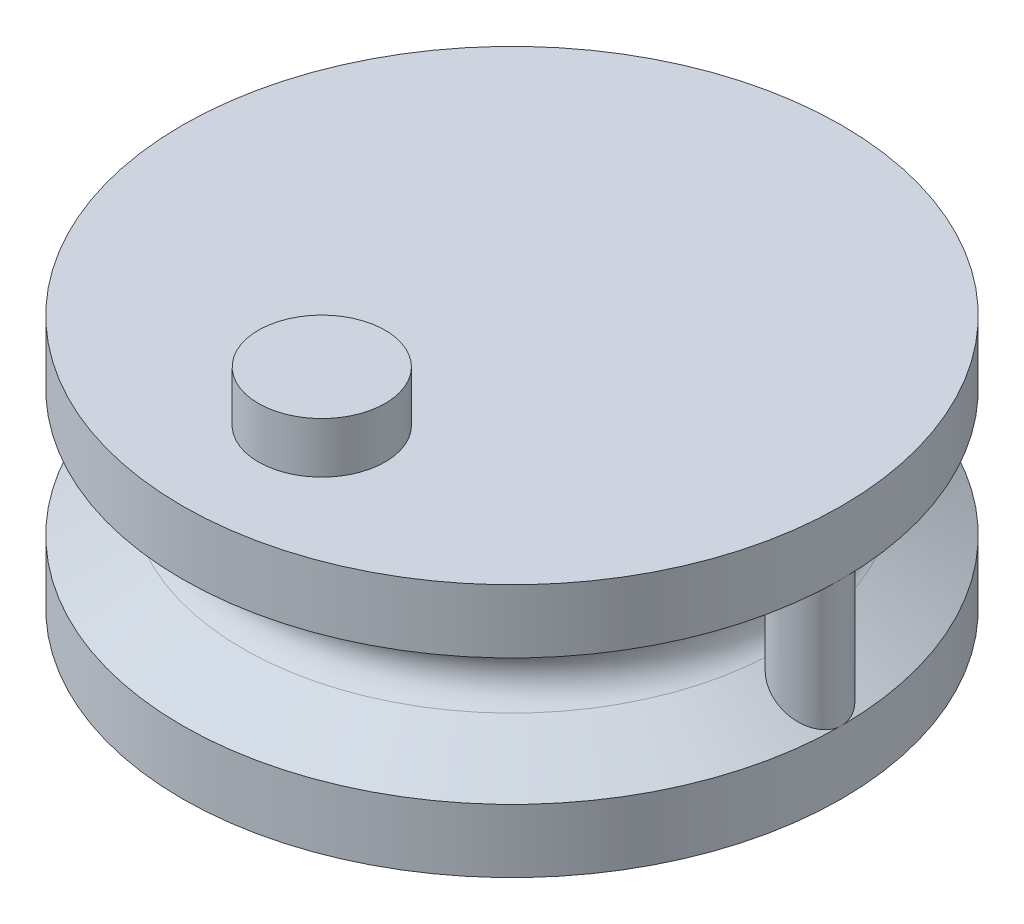
ISO-10303-21;
HEADER;
FILE_DESCRIPTION(('STEP AP214'),'2;1');
FILE_NAME('part.step','',(''),(''),'','','');
FILE_SCHEMA(('AUTOMOTIVE_DESIGN { 1 0 10303 214 1 1 1 1 }'));
ENDSEC;
DATA;
#1=APPLICATION_CONTEXT('core data for automotive mechanical design processes');
#2=APPLICATION_PROTOCOL_DEFINITION('international standard','automotive_design',2000,#1);
#3=PRODUCT_CONTEXT('',#1,'mechanical');
#4=PRODUCT('Part','Part','',(#3));
#5=PRODUCT_RELATED_PRODUCT_CATEGORY('part','',(#4));
#6=PRODUCT_DEFINITION_FORMATION('','',#4);
#7=PRODUCT_DEFINITION_CONTEXT('part definition',#1,'design');
#8=PRODUCT_DEFINITION('design','',#6,#7);
#9=PRODUCT_DEFINITION_SHAPE('','',#8);
#10=(LENGTH_UNIT() NAMED_UNIT(*) SI_UNIT(.MILLI.,.METRE.));
#11=(NAMED_UNIT(*) PLANE_ANGLE_UNIT() SI_UNIT($,.RADIAN.));
#12=(NAMED_UNIT(*) SI_UNIT($,.STERADIAN.) SOLID_ANGLE_UNIT());
#13=UNCERTAINTY_MEASURE_WITH_UNIT(LENGTH_MEASURE(1.E-05),#10,'distance_accuracy_value','');
#14=(GEOMETRIC_REPRESENTATION_CONTEXT(3) GLOBAL_UNCERTAINTY_ASSIGNED_CONTEXT((#13)) GLOBAL_UNIT_ASSIGNED_CONTEXT((#10,
#11,#12)) REPRESENTATION_CONTEXT('',''));
#15=CARTESIAN_POINT('',(0.,0.,0.));
#16=DIRECTION('',(0.,0.,1.));
#17=DIRECTION('',(1.,0.,0.));
#18=AXIS2_PLACEMENT_3D('',#15,#16,#17);
#19=CARTESIAN_POINT('',(0.,0.,0.));
#20=DIRECTION('',(0.,1.,0.));
#21=DIRECTION('',(0.,0.,1.));
#22=AXIS2_PLACEMENT_3D('',#19,#20,#21);
#23=PLANE('',#22);
#24=CARTESIAN_POINT('',(0.,0.,0.));
#25=DIRECTION('',(0.,-1.,0.));
#26=DIRECTION('',(0.,0.,-1.));
#27=AXIS2_PLACEMENT_3D('',#24,#25,#26);
#28=CIRCLE('',#27,5.);
#29=CARTESIAN_POINT('',(0.,0.,-5.));
#30=VERTEX_POINT('',#29);
#31=EDGE_CURVE('E131',#30,#30,#28,.T.);
#32=ORIENTED_EDGE('',*,*,#31,.F.);
#33=EDGE_LOOP('',(#32));
#34=FACE_BOUND('',#33,.T.);
#35=CARTESIAN_POINT('',(0.,0.,0.));
#36=DIRECTION('',(0.,1.,0.));
#37=DIRECTION('',(0.,0.,1.));
#38=AXIS2_PLACEMENT_3D('',#35,#36,#37);
#39=CIRCLE('',#38,13.);
#40=CARTESIAN_POINT('',(0.,0.,13.));
#41=VERTEX_POINT('',#40);
#42=EDGE_CURVE('E11',#41,#41,#39,.T.);
#43=ORIENTED_EDGE('',*,*,#42,.F.);
#44=EDGE_LOOP('',(#43));
#45=FACE_BOUND('',#44,.T.);
#46=ADVANCED_FACE('F41',(#34,#45),#23,.F.);
#47=CARTESIAN_POINT('',(0.,5.,0.));
#48=DIRECTION('',(0.,1.,0.));
#49=DIRECTION('',(0.,0.,1.));
#50=AXIS2_PLACEMENT_3D('',#47,#48,#49);
#51=TOROIDAL_SURFACE('',#50,11.25,1.25);
#52=CARTESIAN_POINT('',(0.,6.07339514328541,0.));
#53=DIRECTION('',(0.,1.,0.));
#54=DIRECTION('',(0.,0.,1.));
#55=AXIS2_PLACEMENT_3D('',#52,#53,#54);
#56=CIRCLE('',#55,10.6094355095923);
#57=CARTESIAN_POINT('',(10.5983030566893,6.07339514328541,-0.485895205541975));
#58=VERTEX_POINT('',#57);
#59=CARTESIAN_POINT('',(10.5983030566892,6.07339514328542,0.485895205541961));
#60=VERTEX_POINT('',#59);
#61=EDGE_CURVE('E86',#58,#60,#56,.T.);
#62=ORIENTED_EDGE('',*,*,#61,.F.);
#63=CARTESIAN_POINT('',(10.5986057774209,6.07359514328844,-0.486612108574577));
#64=CARTESIAN_POINT('',(10.5874376178115,6.06621935586201,-0.460178732302496));
#65=CARTESIAN_POINT('',(10.5771491108793,6.0591221887238,-0.433301970550186));
#66=CARTESIAN_POINT('',(10.5583894184902,6.04576507708734,-0.378684459262579));
#67=CARTESIAN_POINT('',(10.549920338947,6.03950610588804,-0.350942750645623));
#68=CARTESIAN_POINT('',(10.5274174165239,6.022472022018,-0.266743019705615));
#69=CARTESIAN_POINT('',(10.516209247812,6.01338442465254,-0.209125686818043));
#70=CARTESIAN_POINT('',(10.5019598698965,6.00169720924882,-0.0917324433844314));
#71=CARTESIAN_POINT('',(10.4989850841388,5.99915037107196,-0.0319428969526997));
#72=CARTESIAN_POINT('',(10.5016281301411,6.00136409866122,0.0873116197066418));
#73=CARTESIAN_POINT('',(10.5072456908742,6.00612443393841,0.146776600112608));
#74=CARTESIAN_POINT('',(10.5250720913205,6.02047465521608,0.254011373223486));
#75=CARTESIAN_POINT('',(10.5360725095186,6.02916236931784,0.302121266512563));
#76=CARTESIAN_POINT('',(10.5634235033484,6.04949345656177,0.396148457553712));
#77=CARTESIAN_POINT('',(10.5797726702633,6.06113605128694,0.44206632898048));
#78=CARTESIAN_POINT('',(10.5986057774209,6.07359514328844,0.486612108574578));
#79=B_SPLINE_CURVE_WITH_KNOTS('',3,(#63,#64,#65,#66,#67,#68,#69,#70,#71,#72,#73,#74,#75,#76,#77,
#78),.UNSPECIFIED.,.F.,.F.,(4,2,2,2,2,2,2,4),(0.,0.088851869004259,0.177806032882704,
0.355096081658541,0.533812319309718,0.712522919860718,0.862426806079175,1.01229124338235),.UNSPECIFIED.);
#80=EDGE_CURVE('E64',#58,#60,#79,.T.);
#81=ORIENTED_EDGE('',*,*,#80,.T.);
#82=EDGE_LOOP('',(#62,#81));
#83=FACE_BOUND('',#82,.T.);
#84=CARTESIAN_POINT('',(0.,3.92660485671459,0.));
#85=DIRECTION('',(0.,1.,0.));
#86=DIRECTION('',(0.,0.,1.));
#87=AXIS2_PLACEMENT_3D('',#84,#85,#86);
#88=CIRCLE('',#87,10.6094355095923);
#89=CARTESIAN_POINT('',(10.5983030566892,3.9266048567146,-0.485895205541963));
#90=VERTEX_POINT('',#89);
#91=CARTESIAN_POINT('',(10.5983030566893,3.92660485671459,0.485895205541971));
#92=VERTEX_POINT('',#91);
#93=EDGE_CURVE('E96',#90,#92,#88,.T.);
#94=ORIENTED_EDGE('',*,*,#93,.T.);
#95=CARTESIAN_POINT('',(10.5986057774209,3.92640485671157,0.486612108574577));
#96=CARTESIAN_POINT('',(10.5874376178115,3.93378064413799,0.460178732302496));
#97=CARTESIAN_POINT('',(10.5771491108793,3.9408778112762,0.433301970550186));
#98=CARTESIAN_POINT('',(10.5583894184902,3.95423492291266,0.378684459262579));
#99=CARTESIAN_POINT('',(10.549920338947,3.96049389411196,0.350942750645623));
#100=CARTESIAN_POINT('',(10.5274174165239,3.977527977982,0.266743019705615));
#101=CARTESIAN_POINT('',(10.516209247812,3.98661557534746,0.209125686818043));
#102=CARTESIAN_POINT('',(10.5019598698965,3.99830279075118,0.0917324433844314));
#103=CARTESIAN_POINT('',(10.4989850841388,4.00084962892804,0.0319428969526997));
#104=CARTESIAN_POINT('',(10.5016281301411,3.99863590133878,-0.0873116197066418));
#105=CARTESIAN_POINT('',(10.5072456908742,3.99387556606159,-0.146776600112608));
#106=CARTESIAN_POINT('',(10.5250720913205,3.97952534478392,-0.254011373223486));
#107=CARTESIAN_POINT('',(10.5360725095186,3.97083763068216,-0.302121266512563));
#108=CARTESIAN_POINT('',(10.5634235033484,3.95050654343823,-0.396148457553712));
#109=CARTESIAN_POINT('',(10.5797726702633,3.93886394871306,-0.44206632898048));
#110=CARTESIAN_POINT('',(10.5986057774209,3.92640485671157,-0.486612108574578));
#111=B_SPLINE_CURVE_WITH_KNOTS('',3,(#95,#96,#97,#98,#99,#100,#101,#102,#103,#104,#105,#106,
#107,#108,#109,#110),.UNSPECIFIED.,.F.,.F.,(4,2,2,2,2,2,2,4),(0.,0.0888518690042589,
0.177806032882704,0.355096081658541,0.533812319309718,0.712522919860718,0.862426806079175,
1.01229124338235),.UNSPECIFIED.);
#112=EDGE_CURVE('E56',#92,#90,#111,.T.);
#113=ORIENTED_EDGE('',*,*,#112,.T.);
#114=EDGE_LOOP('',(#94,#113));
#115=FACE_BOUND('',#114,.T.);
#116=ADVANCED_FACE('F117',(#83,#115),#51,.F.);
#117=CARTESIAN_POINT('',(0.,10.,0.));
#118=DIRECTION('',(0.,1.,0.));
#119=DIRECTION('',(0.,0.,1.));
#120=AXIS2_PLACEMENT_3D('',#117,#118,#119);
#121=CYLINDRICAL_SURFACE('',#120,13.);
#122=CARTESIAN_POINT('',(0.,2.5,0.));
#123=DIRECTION('',(0.,1.,0.));
#124=DIRECTION('',(0.,0.,1.));
#125=AXIS2_PLACEMENT_3D('',#122,#123,#124);
#126=CIRCLE('',#125,13.);
#127=CARTESIAN_POINT('',(13.0000000000077,2.49999999999583,9.74554015543786E-13));
#128=VERTEX_POINT('',#127);
#129=EDGE_CURVE('E49',#128,#128,#126,.T.);
#130=ORIENTED_EDGE('',*,*,#129,.F.);
#131=EDGE_LOOP('',(#130));
#132=FACE_BOUND('',#131,.T.);
#133=ORIENTED_EDGE('',*,*,#42,.T.);
#134=EDGE_LOOP('',(#133));
#135=FACE_BOUND('',#134,.T.);
#136=ADVANCED_FACE('F114',(#132,#135),#121,.T.);
#137=CARTESIAN_POINT('',(0.,2.5,0.));
#138=DIRECTION('',(0.,-1.,0.));
#139=DIRECTION('',(0.,0.,-1.));
#140=AXIS2_PLACEMENT_3D('',#137,#138,#139);
#141=CONICAL_SURFACE('',#140,13.,1.03275900968104);
#142=ORIENTED_EDGE('',*,*,#93,.F.);
#143=CARTESIAN_POINT('',(10.5980004529343,3.92680485671459,-0.485177332076041));
#144=CARTESIAN_POINT('',(10.6257304926425,3.9084733897933,-0.551106822045929));
#145=CARTESIAN_POINT('',(10.6587348866453,3.88674129855949,-0.613594707935515));
#146=CARTESIAN_POINT('',(10.7332607631536,3.83798342743085,-0.730398670546439));
#147=CARTESIAN_POINT('',(10.7747284238184,3.81099114623759,-0.784762800893945));
#148=CARTESIAN_POINT('',(10.8643677585419,3.75306940458037,-0.884679302956029));
#149=CARTESIAN_POINT('',(10.9125137196765,3.72215508206009,-0.93026394197197));
#150=CARTESIAN_POINT('',(11.0141982953878,3.65737279589803,-1.01261148485055));
#151=CARTESIAN_POINT('',(11.0677462507153,3.62349973025208,-1.04935872328968));
#152=CARTESIAN_POINT('',(11.1862532679122,3.54914553481268,-1.11802576839876));
#153=CARTESIAN_POINT('',(11.2517833777605,3.50838422029922,-1.14865650779568));
#154=CARTESIAN_POINT('',(11.3863187969773,3.4254852120731,-1.19807145689664));
#155=CARTESIAN_POINT('',(11.4553248102176,3.38334724019885,-1.21685325668757));
#156=CARTESIAN_POINT('',(11.6034810887433,3.29371840220463,-1.24392225170286));
#157=CARTESIAN_POINT('',(11.6828752262021,3.24617685859394,-1.25072849837575));
#158=CARTESIAN_POINT('',(11.8420064702492,3.15184401720393,-1.24914767924862));
#159=CARTESIAN_POINT('',(11.9217437127305,3.10505305977363,-1.24075390717977));
#160=CARTESIAN_POINT('',(12.081113255177,3.01241355316657,-1.20815161856453));
#161=CARTESIAN_POINT('',(12.1606999952097,2.96661222236718,-1.18357987757434));
#162=CARTESIAN_POINT('',(12.315051393125,2.87856144215623,-1.11813887874308));
#163=CARTESIAN_POINT('',(12.3898175280562,2.83631090355508,-1.07727464080818));
#164=CARTESIAN_POINT('',(12.5259098787551,2.75998594778746,-0.983249061825821));
#165=CARTESIAN_POINT('',(12.5878249851173,2.72553476879276,-0.931252220234313));
#166=CARTESIAN_POINT('',(12.7017665016568,2.66250010017289,-0.814417380432933));
#167=CARTESIAN_POINT('',(12.7538039797609,2.63391004022765,-0.749593922916129));
#168=CARTESIAN_POINT('',(12.8387389971617,2.58744422135057,-0.618393401891886));
#169=CARTESIAN_POINT('',(12.8732706391943,2.56864391277726,-0.553402238571116));
#170=CARTESIAN_POINT('',(12.9306875777581,2.53746060773138,-0.417049495368043));
#171=CARTESIAN_POINT('',(12.9535848546738,2.52507100964437,-0.345694557923593));
#172=CARTESIAN_POINT('',(12.9842592152873,2.50849113620469,-0.208382970445588));
#173=CARTESIAN_POINT('',(12.9935675198905,2.50347009405495,-0.142865088495687));
#174=CARTESIAN_POINT('',(13.0016929181009,2.49908655868955,-0.0110028808536322));
#175=CARTESIAN_POINT('',(13.0005145311779,2.49972162784864,0.0553410765137992));
#176=CARTESIAN_POINT('',(12.9881222034786,2.50640873608915,0.182780887578219));
#177=CARTESIAN_POINT('',(12.9775101049081,2.51213591760402,0.243953984699323));
#178=CARTESIAN_POINT('',(12.947576046895,2.52832413743864,0.363464451283731));
#179=CARTESIAN_POINT('',(12.9282540177263,2.53878521365498,0.421801798041658));
#180=CARTESIAN_POINT('',(12.881279952681,2.5642914252614,0.535305442755208));
#181=CARTESIAN_POINT('',(12.8534741692602,2.57942123317759,0.590388683738321));
#182=CARTESIAN_POINT('',(12.7907765928815,2.61366550578693,0.694986230819947));
#183=CARTESIAN_POINT('',(12.7558828313708,2.6327810774902,0.744498983871074));
#184=CARTESIAN_POINT('',(12.6770708925453,2.67614980563988,0.840970703082159));
#185=CARTESIAN_POINT('',(12.6326457940498,2.70069664829767,0.88738230540038));
#186=CARTESIAN_POINT('',(12.5383679895887,2.75308050935926,0.972110351000492));
#187=CARTESIAN_POINT('',(12.4885129585613,2.78091893763882,1.01042330568108));
#188=CARTESIAN_POINT('',(12.3785544506262,2.84269822686554,1.08270383360064));
#189=CARTESIAN_POINT('',(12.3179380063715,2.87697086143869,1.1156068066617));
#190=CARTESIAN_POINT('',(12.1933627131127,2.94793742506515,1.17071575598987));
#191=CARTESIAN_POINT('',(12.1294022117072,2.98463255354499,1.19291638745608));
#192=CARTESIAN_POINT('',(11.9916542863301,3.06429358829496,1.22872696823175));
#193=CARTESIAN_POINT('',(11.9176272685544,3.10747495837174,1.24094092701255));
#194=CARTESIAN_POINT('',(11.7691876363497,3.19487670100951,1.2520693408178));
#195=CARTESIAN_POINT('',(11.6947748804794,3.23909747933072,1.25097851292803));
#196=CARTESIAN_POINT('',(11.541017638136,3.3313467532491,1.23502914421577));
#197=CARTESIAN_POINT('',(11.4617932514236,3.37937860917254,1.21900530573863));
#198=CARTESIAN_POINT('',(11.3070822042854,3.47414811305626,1.17169687300017));
#199=CARTESIAN_POINT('',(11.2315992415631,3.5208844613092,1.14039750040606));
#200=CARTESIAN_POINT('',(11.0866472011982,3.61152592737892,1.06265914336575));
#201=CARTESIAN_POINT('',(11.0171919171389,3.65542449566626,1.01618653610862));
#202=CARTESIAN_POINT('',(10.8874390019171,3.73817852129857,0.90859856542604));
#203=CARTESIAN_POINT('',(10.8271106734487,3.7770508166906,0.847534152129413));
#204=CARTESIAN_POINT('',(10.7380759819746,3.83485004299195,0.735959659304307));
#205=CARTESIAN_POINT('',(10.7057579418319,3.85595102385282,0.689431213722903));
#206=CARTESIAN_POINT('',(10.647097174176,3.8944083073285,0.591103421093574));
#207=CARTESIAN_POINT('',(10.6207759245537,3.91175113938535,0.539286061631873));
#208=CARTESIAN_POINT('',(10.5980004529343,3.92680485671459,0.485177332076038));
#209=B_SPLINE_CURVE_WITH_KNOTS('',3,(#143,#144,#145,#146,#147,#148,#149,#150,#151,#152,#153,
#154,#155,#156,#157,#158,#159,#160,#161,#162,#163,#164,#165,#166,#167,#168,#169,#170,#171,#172,
#173,#174,#175,#176,#177,#178,#179,#180,#181,#182,#183,#184,#185,#186,#187,#188,#189,#190,#191,
#192,#193,#194,#195,#196,#197,#198,#199,#200,#201,#202,#203,#204,#205,#206,#207,#208),
.UNSPECIFIED.,.F.,.F.,(4,2,2,2,2,2,2,2,2,2,2,2,2,2,2,2,2,2,2,2,2,2,2,2,2,2,2,2,2,2,2,2,4),(0.,
0.220811507181103,0.440260237125652,0.658886355457387,0.877897206265925,1.12599143564779,
1.37413610776714,1.6512466168733,1.92847941730053,2.21215912039641,2.49575148596747,
2.75788455341726,3.01972214295246,3.24628378237364,3.47261164672745,3.67067341138346,
3.86864982110904,4.05483583727758,4.2410233439608,4.43080858256461,4.62064660269639,
4.82614059808111,5.03172293318531,5.26184507029394,5.4920820127546,5.75069482133525,
6.00941032030706,6.29017232050364,6.57120648427304,6.85286767507853,7.13355940342229,
7.31432558167139,7.49572934949802),.UNSPECIFIED.);
#210=EDGE_CURVE('E112',#90,#128,#209,.T.);
#211=ORIENTED_EDGE('',*,*,#210,.T.);
#212=ORIENTED_EDGE('',*,*,#129,.T.);
#213=EDGE_CURVE('E88',#128,#92,#209,.T.);
#214=ORIENTED_EDGE('',*,*,#213,.T.);
#215=EDGE_LOOP('',(#142,#211,#212,#214));
#216=FACE_BOUND('',#215,.T.);
#217=ADVANCED_FACE('F111',(#216),#141,.T.);
#218=CARTESIAN_POINT('',(0.,6.07339514328541,0.));
#219=DIRECTION('',(0.,1.,0.));
#220=DIRECTION('',(0.,0.,1.));
#221=AXIS2_PLACEMENT_3D('',#218,#219,#220);
#222=CONICAL_SURFACE('',#221,10.6094355095923,1.03275900968104);
#223=ORIENTED_EDGE('',*,*,#61,.T.);
#224=CARTESIAN_POINT('',(10.5980004529343,6.07319514328541,0.485177332076042));
#225=CARTESIAN_POINT('',(10.6257304926425,6.09152661020669,0.551106822045931));
#226=CARTESIAN_POINT('',(10.6587348866453,6.11325870144051,0.613594707935516));
#227=CARTESIAN_POINT('',(10.7332607631536,6.16201657256915,0.73039867054644));
#228=CARTESIAN_POINT('',(10.7747284238184,6.18900885376241,0.784762800893946));
#229=CARTESIAN_POINT('',(10.8643677585419,6.24693059541963,0.88467930295603));
#230=CARTESIAN_POINT('',(10.9125137196765,6.27784491793991,0.930263941971972));
#231=CARTESIAN_POINT('',(11.0141982953878,6.34262720410197,1.01261148485055));
#232=CARTESIAN_POINT('',(11.0677462507153,6.37650026974792,1.04935872328968));
#233=CARTESIAN_POINT('',(11.1862532679122,6.45085446518732,1.11802576839876));
#234=CARTESIAN_POINT('',(11.2517833777605,6.49161577970079,1.14865650779568));
#235=CARTESIAN_POINT('',(11.3863187969773,6.57451478792691,1.19807145689664));
#236=CARTESIAN_POINT('',(11.4553248102176,6.61665275980115,1.21685325668757));
#237=CARTESIAN_POINT('',(11.6034810887433,6.70628159779537,1.24392225170286));
#238=CARTESIAN_POINT('',(11.6828752262021,6.75382314140606,1.25072849837575));
#239=CARTESIAN_POINT('',(11.8420064702492,6.84815598279607,1.24914767924862));
#240=CARTESIAN_POINT('',(11.9217437127305,6.89494694022637,1.24075390717977));
#241=CARTESIAN_POINT('',(12.081113255177,6.98758644683343,1.20815161856453));
#242=CARTESIAN_POINT('',(12.1606999952097,7.03338777763282,1.18357987757434));
#243=CARTESIAN_POINT('',(12.315051393125,7.12143855784377,1.11813887874308));
#244=CARTESIAN_POINT('',(12.3898175280563,7.16368909644492,1.07727464080818));
#245=CARTESIAN_POINT('',(12.5259098787551,7.24001405221254,0.98324906182582));
#246=CARTESIAN_POINT('',(12.5878249851173,7.27446523120724,0.931252220234311));
#247=CARTESIAN_POINT('',(12.7017665016568,7.33749989982711,0.814417380432931));
#248=CARTESIAN_POINT('',(12.7538039797609,7.36608995977235,0.749593922916127));
#249=CARTESIAN_POINT('',(12.8387389971617,7.41255577864943,0.618393401891884));
#250=CARTESIAN_POINT('',(12.8732706391943,7.43135608722274,0.553402238571113));
#251=CARTESIAN_POINT('',(12.9306875777581,7.46253939226862,0.41704949536804));
#252=CARTESIAN_POINT('',(12.9535848546738,7.47492899035563,0.34569455792359));
#253=CARTESIAN_POINT('',(12.9842592152873,7.49150886379531,0.208382970445584));
#254=CARTESIAN_POINT('',(12.9935675198905,7.49652990594505,0.142865088495684));
#255=CARTESIAN_POINT('',(13.0016929181009,7.50091344131045,0.011002880853629));
#256=CARTESIAN_POINT('',(13.0005145311779,7.50027837215136,-0.0553410765138022));
#257=CARTESIAN_POINT('',(12.9881222034786,7.49359126391085,-0.182780887578222));
#258=CARTESIAN_POINT('',(12.9775101049081,7.48786408239598,-0.243953984699326));
#259=CARTESIAN_POINT('',(12.947576046895,7.47167586256136,-0.363464451283734));
#260=CARTESIAN_POINT('',(12.9282540177263,7.46121478634502,-0.421801798041661));
#261=CARTESIAN_POINT('',(12.881279952681,7.4357085747386,-0.535305442755211));
#262=CARTESIAN_POINT('',(12.8534741692602,7.42057876682241,-0.590388683738325));
#263=CARTESIAN_POINT('',(12.7907765928815,7.38633449421307,-0.69498623081995));
#264=CARTESIAN_POINT('',(12.7558828313708,7.3672189225098,-0.744498983871077));
#265=CARTESIAN_POINT('',(12.6770708925453,7.32385019436012,-0.840970703082161));
#266=CARTESIAN_POINT('',(12.6326457940498,7.29930335170233,-0.887382305400382));
#267=CARTESIAN_POINT('',(12.5383679895887,7.24691949064074,-0.972110351000494));
#268=CARTESIAN_POINT('',(12.4885129585613,7.21908106236118,-1.01042330568108));
#269=CARTESIAN_POINT('',(12.3785544506262,7.15730177313445,-1.08270383360064));
#270=CARTESIAN_POINT('',(12.3179380063715,7.12302913856131,-1.11560680666171));
#271=CARTESIAN_POINT('',(12.1933627131127,7.05206257493485,-1.17071575598987));
#272=CARTESIAN_POINT('',(12.1294022117072,7.01536744645501,-1.19291638745608));
#273=CARTESIAN_POINT('',(11.9916542863301,6.93570641170504,-1.22872696823175));
#274=CARTESIAN_POINT('',(11.9176272685544,6.89252504162826,-1.24094092701255));
#275=CARTESIAN_POINT('',(11.7691876363497,6.80512329899049,-1.2520693408178));
#276=CARTESIAN_POINT('',(11.6947748804794,6.76090252066928,-1.25097851292803));
#277=CARTESIAN_POINT('',(11.541017638136,6.6686532467509,-1.23502914421577));
#278=CARTESIAN_POINT('',(11.4617932514236,6.62062139082746,-1.21900530573863));
#279=CARTESIAN_POINT('',(11.3070822042854,6.52585188694374,-1.17169687300017));
#280=CARTESIAN_POINT('',(11.2315992415631,6.4791155386908,-1.14039750040606));
#281=CARTESIAN_POINT('',(11.0866472011982,6.38847407262108,-1.06265914336575));
#282=CARTESIAN_POINT('',(11.0171919171389,6.34457550433374,-1.01618653610862));
#283=CARTESIAN_POINT('',(10.8874390019171,6.26182147870143,-0.908598565426038));
#284=CARTESIAN_POINT('',(10.8271106734487,6.2229491833094,-0.847534152129411));
#285=CARTESIAN_POINT('',(10.7380759819746,6.16514995700805,-0.735959659304305));
#286=CARTESIAN_POINT('',(10.7057579418319,6.14404897614718,-0.689431213722903));
#287=CARTESIAN_POINT('',(10.647097174176,6.1055916926715,-0.591103421093576));
#288=CARTESIAN_POINT('',(10.6207759245537,6.08824886061465,-0.539286061631877));
#289=CARTESIAN_POINT('',(10.5980004529343,6.07319514328541,-0.485177332076043));
#290=B_SPLINE_CURVE_WITH_KNOTS('',3,(#224,#225,#226,#227,#228,#229,#230,#231,#232,#233,#234,
#235,#236,#237,#238,#239,#240,#241,#242,#243,#244,#245,#246,#247,#248,#249,#250,#251,#252,#253,
#254,#255,#256,#257,#258,#259,#260,#261,#262,#263,#264,#265,#266,#267,#268,#269,#270,#271,#272,
#273,#274,#275,#276,#277,#278,#279,#280,#281,#282,#283,#284,#285,#286,#287,#288,#289),
.UNSPECIFIED.,.F.,.F.,(4,2,2,2,2,2,2,2,2,2,2,2,2,2,2,2,2,2,2,2,2,2,2,2,2,2,2,2,2,2,2,2,4),(0.,
0.220811507181104,0.440260237125653,0.658886355457389,0.877897206265927,1.12599143564779,
1.37413610776714,1.6512466168733,1.92847941730054,2.21215912039641,2.49575148596747,
2.75788455341727,3.01972214295246,3.24628378237364,3.47261164672745,3.67067341138346,
3.86864982110904,4.05483583727758,4.2410233439608,4.43080858256462,4.62064660269639,
4.82614059808112,5.03172293318531,5.26184507029394,5.4920820127546,5.75069482133526,
6.00941032030706,6.29017232050364,6.57120648427305,6.85286767507853,7.13355940342229,
7.31432558167139,7.49572934949801),.UNSPECIFIED.);
#291=CARTESIAN_POINT('',(13.,7.5,0.));
#292=VERTEX_POINT('',#291);
#293=EDGE_CURVE('E76',#60,#292,#290,.T.);
#294=ORIENTED_EDGE('',*,*,#293,.T.);
#295=CARTESIAN_POINT('',(0.,7.5,0.));
#296=DIRECTION('',(0.,1.,0.));
#297=DIRECTION('',(0.,0.,1.));
#298=AXIS2_PLACEMENT_3D('',#295,#296,#297);
#299=CIRCLE('',#298,13.);
#300=EDGE_CURVE('E85',#292,#292,#299,.T.);
#301=ORIENTED_EDGE('',*,*,#300,.F.);
#302=EDGE_CURVE('E73',#292,#58,#290,.T.);
#303=ORIENTED_EDGE('',*,*,#302,.T.);
#304=EDGE_LOOP('',(#223,#294,#301,#303));
#305=FACE_BOUND('',#304,.T.);
#306=ADVANCED_FACE('F84',(#305),#222,.T.);
#307=CARTESIAN_POINT('',(0.,10.,0.));
#308=DIRECTION('',(0.,1.,0.));
#309=DIRECTION('',(0.,0.,1.));
#310=AXIS2_PLACEMENT_3D('',#307,#308,#309);
#311=CYLINDRICAL_SURFACE('',#310,13.);
#312=CARTESIAN_POINT('',(0.,10.,0.));
#313=DIRECTION('',(0.,1.,0.));
#314=DIRECTION('',(0.,0.,1.));
#315=AXIS2_PLACEMENT_3D('',#312,#313,#314);
#316=CIRCLE('',#315,13.);
#317=CARTESIAN_POINT('',(0.,10.,13.));
#318=VERTEX_POINT('',#317);
#319=EDGE_CURVE('E92',#318,#318,#316,.T.);
#320=ORIENTED_EDGE('',*,*,#319,.F.);
#321=EDGE_LOOP('',(#320));
#322=FACE_BOUND('',#321,.T.);
#323=ORIENTED_EDGE('',*,*,#300,.T.);
#324=EDGE_LOOP('',(#323));
#325=FACE_BOUND('',#324,.T.);
#326=ADVANCED_FACE('F90',(#322,#325),#311,.T.);
#327=CARTESIAN_POINT('',(0.,10.,0.));
#328=DIRECTION('',(0.,1.,0.));
#329=DIRECTION('',(0.,0.,1.));
#330=AXIS2_PLACEMENT_3D('',#327,#328,#329);
#331=PLANE('',#330);
#332=CARTESIAN_POINT('',(0.,10.,7.5));
#333=DIRECTION('',(0.,1.,0.));
#334=DIRECTION('',(0.,0.,1.));
#335=AXIS2_PLACEMENT_3D('',#332,#333,#334);
#336=CIRCLE('',#335,2.5);
#337=CARTESIAN_POINT('',(0.,10.,10.));
#338=VERTEX_POINT('',#337);
#339=EDGE_CURVE('E140',#338,#338,#336,.T.);
#340=ORIENTED_EDGE('',*,*,#339,.F.);
#341=EDGE_LOOP('',(#340));
#342=FACE_BOUND('',#341,.T.);
#343=ORIENTED_EDGE('',*,*,#319,.T.);
#344=EDGE_LOOP('',(#343));
#345=FACE_BOUND('',#344,.T.);
#346=ADVANCED_FACE('F186',(#342,#345),#331,.T.);
#347=CARTESIAN_POINT('',(0.,5.,0.));
#348=DIRECTION('',(0.,-1.,0.));
#349=DIRECTION('',(0.,0.,-1.));
#350=AXIS2_PLACEMENT_3D('',#347,#348,#349);
#351=CYLINDRICAL_SURFACE('',#350,5.);
#352=CARTESIAN_POINT('',(0.,5.,0.));
#353=DIRECTION('',(0.,-1.,0.));
#354=DIRECTION('',(0.,0.,-1.));
#355=AXIS2_PLACEMENT_3D('',#352,#353,#354);
#356=CIRCLE('',#355,5.);
#357=CARTESIAN_POINT('',(0.,5.,-5.));
#358=VERTEX_POINT('',#357);
#359=EDGE_CURVE('E99',#358,#358,#356,.T.);
#360=ORIENTED_EDGE('',*,*,#359,.F.);
#361=EDGE_LOOP('',(#360));
#362=FACE_BOUND('',#361,.T.);
#363=ORIENTED_EDGE('',*,*,#31,.T.);
#364=EDGE_LOOP('',(#363));
#365=FACE_BOUND('',#364,.T.);
#366=ADVANCED_FACE('F188',(#362,#365),#351,.F.);
#367=CARTESIAN_POINT('',(0.,5.,0.));
#368=DIRECTION('',(0.,-1.,0.));
#369=DIRECTION('',(0.,0.,-1.));
#370=AXIS2_PLACEMENT_3D('',#367,#368,#369);
#371=PLANE('',#370);
#372=ORIENTED_EDGE('',*,*,#359,.T.);
#373=EDGE_LOOP('',(#372));
#374=FACE_BOUND('',#373,.T.);
#375=ADVANCED_FACE('F191',(#374),#371,.T.);
#376=CARTESIAN_POINT('',(0.,12.,7.5));
#377=DIRECTION('',(0.,-1.,0.));
#378=DIRECTION('',(0.,0.,-1.));
#379=AXIS2_PLACEMENT_3D('',#376,#377,#378);
#380=CYLINDRICAL_SURFACE('',#379,2.5);
#381=CARTESIAN_POINT('',(0.,12.,7.5));
#382=DIRECTION('',(0.,1.,0.));
#383=DIRECTION('',(0.,0.,1.));
#384=AXIS2_PLACEMENT_3D('',#381,#382,#383);
#385=CIRCLE('',#384,2.5);
#386=CARTESIAN_POINT('',(0.,12.,10.));
#387=VERTEX_POINT('',#386);
#388=EDGE_CURVE('E134',#387,#387,#385,.T.);
#389=ORIENTED_EDGE('',*,*,#388,.F.);
#390=EDGE_LOOP('',(#389));
#391=FACE_BOUND('',#390,.T.);
#392=ORIENTED_EDGE('',*,*,#339,.T.);
#393=EDGE_LOOP('',(#392));
#394=FACE_BOUND('',#393,.T.);
#395=ADVANCED_FACE('F194',(#391,#394),#380,.T.);
#396=CARTESIAN_POINT('',(0.,12.,7.5));
#397=DIRECTION('',(0.,1.,0.));
#398=DIRECTION('',(0.,0.,1.));
#399=AXIS2_PLACEMENT_3D('',#396,#397,#398);
#400=PLANE('',#399);
#401=ORIENTED_EDGE('',*,*,#388,.T.);
#402=EDGE_LOOP('',(#401));
#403=FACE_BOUND('',#402,.T.);
#404=ADVANCED_FACE('F164',(#403),#400,.T.);
#405=CARTESIAN_POINT('',(11.75,-3.53553390593274,0.));
#406=DIRECTION('',(0.,1.,0.));
#407=DIRECTION('',(0.,0.,1.));
#408=AXIS2_PLACEMENT_3D('',#405,#406,#407);
#409=CYLINDRICAL_SURFACE('',#408,1.25);
#410=ORIENTED_EDGE('',*,*,#293,.F.);
#411=ORIENTED_EDGE('',*,*,#80,.F.);
#412=ORIENTED_EDGE('',*,*,#302,.F.);
#413=EDGE_LOOP('',(#410,#411,#412));
#414=FACE_BOUND('',#413,.T.);
#415=ORIENTED_EDGE('',*,*,#112,.F.);
#416=ORIENTED_EDGE('',*,*,#213,.F.);
#417=ORIENTED_EDGE('',*,*,#210,.F.);
#418=EDGE_LOOP('',(#415,#416,#417));
#419=FACE_BOUND('',#418,.T.);
#420=ADVANCED_FACE('F75',(#414,#419),#409,.T.);
#421=CLOSED_SHELL('',(#46,#116,#136,#217,#306,#326,#346,#366,#375,#395,#404,#420));
#422=MANIFOLD_SOLID_BREP('B2',#421);
#423=ADVANCED_BREP_SHAPE_REPRESENTATION('',(#18,#422),#14);
#424=SHAPE_DEFINITION_REPRESENTATION(#9,#423);
ENDSEC;
END-ISO-10303-21;
